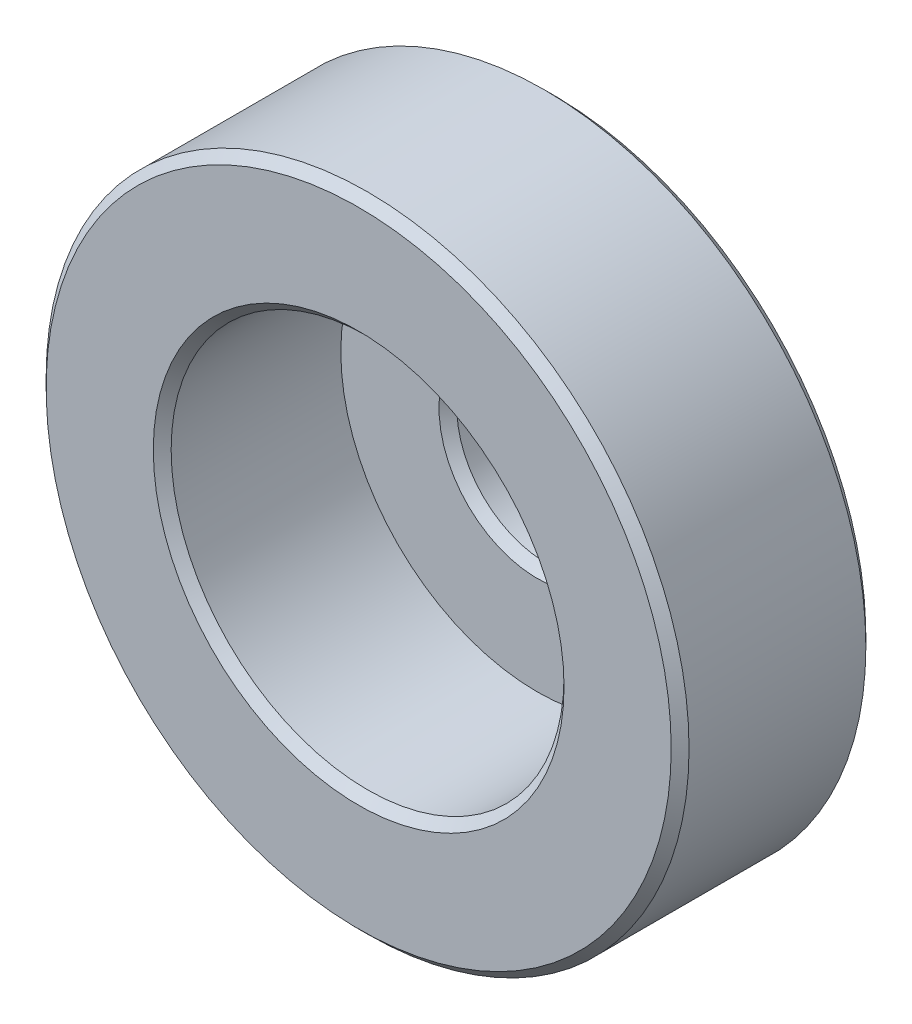
ISO-10303-21;
HEADER;
FILE_DESCRIPTION(('STEP AP214'),'2;1');
FILE_NAME('part.step','',(''),(''),'','','');
FILE_SCHEMA(('AUTOMOTIVE_DESIGN { 1 0 10303 214 1 1 1 1 }'));
ENDSEC;
DATA;
#1=APPLICATION_CONTEXT('core data for automotive mechanical design processes');
#2=APPLICATION_PROTOCOL_DEFINITION('international standard','automotive_design',2000,#1);
#3=PRODUCT_CONTEXT('',#1,'mechanical');
#4=PRODUCT('Part','Part','',(#3));
#5=PRODUCT_RELATED_PRODUCT_CATEGORY('part','',(#4));
#6=PRODUCT_DEFINITION_FORMATION('','',#4);
#7=PRODUCT_DEFINITION_CONTEXT('part definition',#1,'design');
#8=PRODUCT_DEFINITION('design','',#6,#7);
#9=PRODUCT_DEFINITION_SHAPE('','',#8);
#10=(LENGTH_UNIT() NAMED_UNIT(*) SI_UNIT(.MILLI.,.METRE.));
#11=(NAMED_UNIT(*) PLANE_ANGLE_UNIT() SI_UNIT($,.RADIAN.));
#12=(NAMED_UNIT(*) SI_UNIT($,.STERADIAN.) SOLID_ANGLE_UNIT());
#13=UNCERTAINTY_MEASURE_WITH_UNIT(LENGTH_MEASURE(1.E-05),#10,'distance_accuracy_value','');
#14=(GEOMETRIC_REPRESENTATION_CONTEXT(3) GLOBAL_UNCERTAINTY_ASSIGNED_CONTEXT((#13)) GLOBAL_UNIT_ASSIGNED_CONTEXT((#10,
#11,#12)) REPRESENTATION_CONTEXT('',''));
#15=CARTESIAN_POINT('',(0.,0.,0.));
#16=DIRECTION('',(0.,0.,1.));
#17=DIRECTION('',(1.,0.,0.));
#18=AXIS2_PLACEMENT_3D('',#15,#16,#17);
#19=CARTESIAN_POINT('',(-11.,0.,0.));
#20=DIRECTION('',(0.,0.,-1.));
#21=DIRECTION('',(-1.,0.,0.));
#22=AXIS2_PLACEMENT_3D('',#19,#20,#21);
#23=PLANE('',#22);
#24=DIRECTION('',(0.,1.,0.));
#25=VECTOR('',#24,1.);
#26=CARTESIAN_POINT('',(-1.25,-4.84122918275927,0.));
#27=LINE('',#26,#25);
#28=CARTESIAN_POINT('',(-1.25,-10.4253297309965,0.));
#29=VERTEX_POINT('',#28);
#30=CARTESIAN_POINT('',(-1.25,-4.84122918275927,0.));
#31=VERTEX_POINT('',#30);
#32=EDGE_CURVE('E133',#29,#31,#27,.T.);
#33=ORIENTED_EDGE('',*,*,#32,.F.);
#34=CARTESIAN_POINT('',(0.,0.,0.));
#35=DIRECTION('',(0.,0.,-1.));
#36=DIRECTION('',(-1.,0.,0.));
#37=AXIS2_PLACEMENT_3D('',#34,#35,#36);
#38=CIRCLE('',#37,10.5);
#39=CARTESIAN_POINT('',(-1.25,10.4253297309965,0.));
#40=VERTEX_POINT('',#39);
#41=EDGE_CURVE('E209',#29,#40,#38,.T.);
#42=ORIENTED_EDGE('',*,*,#41,.T.);
#43=DIRECTION('',(0.,1.,0.));
#44=VECTOR('',#43,1.);
#45=CARTESIAN_POINT('',(-1.25,10.9409689664164,0.));
#46=LINE('',#45,#44);
#47=CARTESIAN_POINT('',(-1.25,4.84122918275927,0.));
#48=VERTEX_POINT('',#47);
#49=EDGE_CURVE('E142',#48,#40,#46,.T.);
#50=ORIENTED_EDGE('',*,*,#49,.F.);
#51=CARTESIAN_POINT('',(0.,0.,0.));
#52=DIRECTION('',(0.,0.,-1.));
#53=DIRECTION('',(-1.,0.,0.));
#54=AXIS2_PLACEMENT_3D('',#51,#52,#53);
#55=CIRCLE('',#54,5.);
#56=EDGE_CURVE('E167',#31,#48,#55,.T.);
#57=ORIENTED_EDGE('',*,*,#56,.F.);
#58=EDGE_LOOP('',(#33,#42,#50,#57));
#59=FACE_BOUND('',#58,.T.);
#60=ADVANCED_FACE('F33',(#59),#23,.T.);
#61=CARTESIAN_POINT('',(-18.,0.,15.4));
#62=DIRECTION('',(0.,0.,1.));
#63=DIRECTION('',(1.,0.,0.));
#64=AXIS2_PLACEMENT_3D('',#61,#62,#63);
#65=PLANE('',#64);
#66=CARTESIAN_POINT('',(0.,0.,15.4));
#67=DIRECTION('',(0.,0.,1.));
#68=DIRECTION('',(1.,0.,0.));
#69=AXIS2_PLACEMENT_3D('',#66,#67,#68);
#70=CIRCLE('',#69,11.5);
#71=CARTESIAN_POINT('',(11.5,0.,15.4));
#72=VERTEX_POINT('',#71);
#73=EDGE_CURVE('E194',#72,#72,#70,.F.);
#74=ORIENTED_EDGE('',*,*,#73,.T.);
#75=EDGE_LOOP('',(#74));
#76=FACE_BOUND('',#75,.T.);
#77=CARTESIAN_POINT('',(0.,0.,15.4));
#78=DIRECTION('',(0.,0.,1.));
#79=DIRECTION('',(1.,0.,0.));
#80=AXIS2_PLACEMENT_3D('',#77,#78,#79);
#81=CIRCLE('',#80,17.5);
#82=CARTESIAN_POINT('',(17.5,0.,15.4));
#83=VERTEX_POINT('',#82);
#84=EDGE_CURVE('E191',#83,#83,#81,.T.);
#85=ORIENTED_EDGE('',*,*,#84,.T.);
#86=EDGE_LOOP('',(#85));
#87=FACE_BOUND('',#86,.T.);
#88=ADVANCED_FACE('F258',(#76,#87),#65,.T.);
#89=CARTESIAN_POINT('',(0.,0.,0.));
#90=DIRECTION('',(0.,0.,-1.));
#91=DIRECTION('',(-1.,0.,0.));
#92=AXIS2_PLACEMENT_3D('',#89,#90,#91);
#93=CYLINDRICAL_SURFACE('',#92,11.);
#94=CARTESIAN_POINT('',(0.,0.,14.9));
#95=DIRECTION('',(0.,0.,1.));
#96=DIRECTION('',(1.,0.,0.));
#97=AXIS2_PLACEMENT_3D('',#94,#95,#96);
#98=CIRCLE('',#97,11.);
#99=CARTESIAN_POINT('',(11.,0.,14.9));
#100=VERTEX_POINT('',#99);
#101=EDGE_CURVE('E197',#100,#100,#98,.T.);
#102=ORIENTED_EDGE('',*,*,#101,.T.);
#103=EDGE_LOOP('',(#102));
#104=FACE_BOUND('',#103,.T.);
#105=CARTESIAN_POINT('',(0.,0.,5.4));
#106=DIRECTION('',(0.,0.,-1.));
#107=DIRECTION('',(-1.,0.,0.));
#108=AXIS2_PLACEMENT_3D('',#105,#106,#107);
#109=CIRCLE('',#108,11.);
#110=CARTESIAN_POINT('',(-11.,0.,5.4));
#111=VERTEX_POINT('',#110);
#112=EDGE_CURVE('E169',#111,#111,#109,.T.);
#113=ORIENTED_EDGE('',*,*,#112,.T.);
#114=EDGE_LOOP('',(#113));
#115=FACE_BOUND('',#114,.T.);
#116=ADVANCED_FACE('F254',(#104,#115),#93,.F.);
#117=CARTESIAN_POINT('',(-11.,0.,5.4));
#118=DIRECTION('',(0.,0.,1.));
#119=DIRECTION('',(1.,0.,0.));
#120=AXIS2_PLACEMENT_3D('',#117,#118,#119);
#121=PLANE('',#120);
#122=CARTESIAN_POINT('',(0.,0.,5.4));
#123=DIRECTION('',(0.,0.,1.));
#124=DIRECTION('',(1.,0.,0.));
#125=AXIS2_PLACEMENT_3D('',#122,#123,#124);
#126=CIRCLE('',#125,5.49999999999998);
#127=CARTESIAN_POINT('',(5.49999999999999,0.,5.4));
#128=VERTEX_POINT('',#127);
#129=EDGE_CURVE('E185',#128,#128,#126,.F.);
#130=ORIENTED_EDGE('',*,*,#129,.T.);
#131=EDGE_LOOP('',(#130));
#132=FACE_BOUND('',#131,.T.);
#133=ORIENTED_EDGE('',*,*,#112,.F.);
#134=EDGE_LOOP('',(#133));
#135=FACE_BOUND('',#134,.T.);
#136=ADVANCED_FACE('F250',(#132,#135),#121,.T.);
#137=CARTESIAN_POINT('',(0.,0.,0.));
#138=DIRECTION('',(0.,0.,-1.));
#139=DIRECTION('',(-1.,0.,0.));
#140=AXIS2_PLACEMENT_3D('',#137,#138,#139);
#141=CYLINDRICAL_SURFACE('',#140,5.);
#142=CARTESIAN_POINT('',(0.,0.,4.90000000000001));
#143=DIRECTION('',(0.,0.,1.));
#144=DIRECTION('',(1.,0.,0.));
#145=AXIS2_PLACEMENT_3D('',#142,#143,#144);
#146=CIRCLE('',#145,5.);
#147=CARTESIAN_POINT('',(5.,0.,4.90000000000001));
#148=VERTEX_POINT('',#147);
#149=EDGE_CURVE('E188',#148,#148,#146,.T.);
#150=ORIENTED_EDGE('',*,*,#149,.T.);
#151=EDGE_LOOP('',(#150));
#152=FACE_BOUND('',#151,.T.);
#153=DIRECTION('',(0.,0.,-1.));
#154=VECTOR('',#153,1.);
#155=CARTESIAN_POINT('',(-1.25,-4.84122918275927,1.5));
#156=LINE('',#155,#154);
#157=CARTESIAN_POINT('',(-1.25,-4.84122918275927,1.5));
#158=VERTEX_POINT('',#157);
#159=EDGE_CURVE('E140',#158,#31,#156,.T.);
#160=ORIENTED_EDGE('',*,*,#159,.T.);
#161=ORIENTED_EDGE('',*,*,#56,.T.);
#162=DIRECTION('',(0.,0.,-1.));
#163=VECTOR('',#162,1.);
#164=CARTESIAN_POINT('',(-1.25,4.84122918275927,1.5));
#165=LINE('',#164,#163);
#166=CARTESIAN_POINT('',(-1.25,4.84122918275927,1.5));
#167=VERTEX_POINT('',#166);
#168=EDGE_CURVE('E156',#167,#48,#165,.T.);
#169=ORIENTED_EDGE('',*,*,#168,.F.);
#170=CARTESIAN_POINT('',(0.,0.,1.5));
#171=DIRECTION('',(0.,0.,1.));
#172=DIRECTION('',(-1.,0.,0.));
#173=AXIS2_PLACEMENT_3D('',#170,#171,#172);
#174=CIRCLE('',#173,5.);
#175=CARTESIAN_POINT('',(1.25,4.84122918275927,1.5));
#176=VERTEX_POINT('',#175);
#177=EDGE_CURVE('E147',#176,#167,#174,.T.);
#178=ORIENTED_EDGE('',*,*,#177,.F.);
#179=DIRECTION('',(0.,0.,-1.));
#180=VECTOR('',#179,1.);
#181=CARTESIAN_POINT('',(1.25,4.84122918275927,1.5));
#182=LINE('',#181,#180);
#183=CARTESIAN_POINT('',(1.25,4.84122918275927,0.));
#184=VERTEX_POINT('',#183);
#185=EDGE_CURVE('E160',#176,#184,#182,.T.);
#186=ORIENTED_EDGE('',*,*,#185,.T.);
#187=CARTESIAN_POINT('',(1.25,-4.84122918275927,0.));
#188=VERTEX_POINT('',#187);
#189=EDGE_CURVE('E139',#184,#188,#55,.T.);
#190=ORIENTED_EDGE('',*,*,#189,.T.);
#191=DIRECTION('',(0.,0.,-1.));
#192=VECTOR('',#191,1.);
#193=CARTESIAN_POINT('',(1.25,-4.84122918275927,1.5));
#194=LINE('',#193,#192);
#195=CARTESIAN_POINT('',(1.25,-4.84122918275927,1.5));
#196=VERTEX_POINT('',#195);
#197=EDGE_CURVE('E118',#196,#188,#194,.T.);
#198=ORIENTED_EDGE('',*,*,#197,.F.);
#199=CARTESIAN_POINT('',(0.,0.,1.5));
#200=DIRECTION('',(0.,0.,1.));
#201=DIRECTION('',(-1.,0.,0.));
#202=AXIS2_PLACEMENT_3D('',#199,#200,#201);
#203=CIRCLE('',#202,5.);
#204=EDGE_CURVE('E125',#158,#196,#203,.T.);
#205=ORIENTED_EDGE('',*,*,#204,.F.);
#206=EDGE_LOOP('',(#160,#161,#169,#178,#186,#190,#198,#205));
#207=FACE_BOUND('',#206,.T.);
#208=ADVANCED_FACE('F136',(#152,#207),#141,.F.);
#209=DIRECTION('',(0.,-1.,0.));
#210=VECTOR('',#209,1.);
#211=CARTESIAN_POINT('',(1.25,10.9409689664164,0.));
#212=LINE('',#211,#210);
#213=CARTESIAN_POINT('',(1.25,10.4253297309965,0.));
#214=VERTEX_POINT('',#213);
#215=EDGE_CURVE('E151',#214,#184,#212,.T.);
#216=ORIENTED_EDGE('',*,*,#215,.F.);
#217=CARTESIAN_POINT('',(0.,0.,0.));
#218=DIRECTION('',(0.,0.,-1.));
#219=DIRECTION('',(-1.,0.,0.));
#220=AXIS2_PLACEMENT_3D('',#217,#218,#219);
#221=CIRCLE('',#220,10.5);
#222=CARTESIAN_POINT('',(1.25,-10.4253297309965,0.));
#223=VERTEX_POINT('',#222);
#224=EDGE_CURVE('E307',#214,#223,#221,.T.);
#225=ORIENTED_EDGE('',*,*,#224,.T.);
#226=DIRECTION('',(0.,-1.,0.));
#227=VECTOR('',#226,1.);
#228=CARTESIAN_POINT('',(1.25,-4.84122918275927,0.));
#229=LINE('',#228,#227);
#230=EDGE_CURVE('E292',#188,#223,#229,.T.);
#231=ORIENTED_EDGE('',*,*,#230,.F.);
#232=ORIENTED_EDGE('',*,*,#189,.F.);
#233=EDGE_LOOP('',(#216,#225,#231,#232));
#234=FACE_BOUND('',#233,.T.);
#235=ADVANCED_FACE('F243',(#234),#23,.T.);
#236=CARTESIAN_POINT('',(0.,0.,0.));
#237=DIRECTION('',(0.,0.,-1.));
#238=DIRECTION('',(-1.,0.,0.));
#239=AXIS2_PLACEMENT_3D('',#236,#237,#238);
#240=CYLINDRICAL_SURFACE('',#239,11.);
#241=DIRECTION('',(0.,0.,-1.));
#242=VECTOR('',#241,1.);
#243=CARTESIAN_POINT('',(-1.25,10.9287464971972,0.));
#244=LINE('',#243,#242);
#245=CARTESIAN_POINT('',(-1.25,10.9287464971972,0.499999999999997));
#246=VERTEX_POINT('',#245);
#247=CARTESIAN_POINT('',(-1.25,10.9287464971972,1.5));
#248=VERTEX_POINT('',#247);
#249=EDGE_CURVE('E175',#246,#248,#244,.F.);
#250=ORIENTED_EDGE('',*,*,#249,.F.);
#251=CARTESIAN_POINT('',(0.,0.,0.499999999999997));
#252=DIRECTION('',(0.,0.,-1.));
#253=DIRECTION('',(-1.,0.,0.));
#254=AXIS2_PLACEMENT_3D('',#251,#252,#253);
#255=CIRCLE('',#254,11.);
#256=CARTESIAN_POINT('',(-1.25,-10.9287464971972,0.499999999999997));
#257=VERTEX_POINT('',#256);
#258=EDGE_CURVE('E296',#246,#257,#255,.F.);
#259=ORIENTED_EDGE('',*,*,#258,.T.);
#260=DIRECTION('',(0.,0.,-1.));
#261=VECTOR('',#260,1.);
#262=CARTESIAN_POINT('',(-1.25,-10.9287464971972,0.));
#263=LINE('',#262,#261);
#264=CARTESIAN_POINT('',(-1.25,-10.9287464971972,1.5));
#265=VERTEX_POINT('',#264);
#266=EDGE_CURVE('E182',#265,#257,#263,.T.);
#267=ORIENTED_EDGE('',*,*,#266,.F.);
#268=CARTESIAN_POINT('',(0.,0.,1.5));
#269=DIRECTION('',(0.,0.,-1.));
#270=DIRECTION('',(-1.,0.,0.));
#271=AXIS2_PLACEMENT_3D('',#268,#269,#270);
#272=CIRCLE('',#271,11.);
#273=CARTESIAN_POINT('',(1.25,-10.9287464971972,1.5));
#274=VERTEX_POINT('',#273);
#275=EDGE_CURVE('E179',#265,#274,#272,.F.);
#276=ORIENTED_EDGE('',*,*,#275,.T.);
#277=DIRECTION('',(0.,0.,-1.));
#278=VECTOR('',#277,1.);
#279=CARTESIAN_POINT('',(1.25,-10.9287464971972,0.));
#280=LINE('',#279,#278);
#281=CARTESIAN_POINT('',(1.25,-10.9287464971972,0.5));
#282=VERTEX_POINT('',#281);
#283=EDGE_CURVE('E121',#282,#274,#280,.F.);
#284=ORIENTED_EDGE('',*,*,#283,.F.);
#285=CARTESIAN_POINT('',(0.,0.,0.500000000000001));
#286=DIRECTION('',(0.,0.,-1.));
#287=DIRECTION('',(-1.,0.,0.));
#288=AXIS2_PLACEMENT_3D('',#285,#286,#287);
#289=CIRCLE('',#288,11.);
#290=CARTESIAN_POINT('',(1.25,10.9287464971972,0.5));
#291=VERTEX_POINT('',#290);
#292=EDGE_CURVE('E218',#282,#291,#289,.F.);
#293=ORIENTED_EDGE('',*,*,#292,.T.);
#294=DIRECTION('',(0.,0.,-1.));
#295=VECTOR('',#294,1.);
#296=CARTESIAN_POINT('',(1.25,10.9287464971972,0.));
#297=LINE('',#296,#295);
#298=CARTESIAN_POINT('',(1.25,10.9287464971972,1.5));
#299=VERTEX_POINT('',#298);
#300=EDGE_CURVE('E177',#299,#291,#297,.T.);
#301=ORIENTED_EDGE('',*,*,#300,.F.);
#302=CARTESIAN_POINT('',(0.,0.,1.5));
#303=DIRECTION('',(0.,0.,-1.));
#304=DIRECTION('',(-1.,0.,0.));
#305=AXIS2_PLACEMENT_3D('',#302,#303,#304);
#306=CIRCLE('',#305,11.);
#307=EDGE_CURVE('E172',#299,#248,#306,.F.);
#308=ORIENTED_EDGE('',*,*,#307,.T.);
#309=EDGE_LOOP('',(#250,#259,#267,#276,#284,#293,#301,#308));
#310=FACE_BOUND('',#309,.T.);
#311=CARTESIAN_POINT('',(0.,0.,4.5));
#312=DIRECTION('',(0.,0.,-1.));
#313=DIRECTION('',(-1.,0.,0.));
#314=AXIS2_PLACEMENT_3D('',#311,#312,#313);
#315=CIRCLE('',#314,11.);
#316=CARTESIAN_POINT('',(-11.,0.,4.5));
#317=VERTEX_POINT('',#316);
#318=EDGE_CURVE('E162',#317,#317,#315,.T.);
#319=ORIENTED_EDGE('',*,*,#318,.T.);
#320=EDGE_LOOP('',(#319));
#321=FACE_BOUND('',#320,.T.);
#322=ADVANCED_FACE('F239',(#310,#321),#240,.T.);
#323=CARTESIAN_POINT('',(-18.,0.,4.5));
#324=DIRECTION('',(0.,0.,-1.));
#325=DIRECTION('',(-1.,0.,0.));
#326=AXIS2_PLACEMENT_3D('',#323,#324,#325);
#327=PLANE('',#326);
#328=CARTESIAN_POINT('',(0.,0.,4.5));
#329=DIRECTION('',(0.,0.,-1.));
#330=DIRECTION('',(-1.,0.,0.));
#331=AXIS2_PLACEMENT_3D('',#328,#329,#330);
#332=CIRCLE('',#331,17.5);
#333=CARTESIAN_POINT('',(-17.5,0.,4.5));
#334=VERTEX_POINT('',#333);
#335=EDGE_CURVE('E206',#334,#334,#332,.T.);
#336=ORIENTED_EDGE('',*,*,#335,.T.);
#337=EDGE_LOOP('',(#336));
#338=FACE_BOUND('',#337,.T.);
#339=ORIENTED_EDGE('',*,*,#318,.F.);
#340=EDGE_LOOP('',(#339));
#341=FACE_BOUND('',#340,.T.);
#342=ADVANCED_FACE('F235',(#338,#341),#327,.T.);
#343=CARTESIAN_POINT('',(0.,0.,0.));
#344=DIRECTION('',(0.,0.,-1.));
#345=DIRECTION('',(-1.,0.,0.));
#346=AXIS2_PLACEMENT_3D('',#343,#344,#345);
#347=CYLINDRICAL_SURFACE('',#346,18.);
#348=CARTESIAN_POINT('',(0.,0.,14.9));
#349=DIRECTION('',(0.,0.,1.));
#350=DIRECTION('',(1.,0.,0.));
#351=AXIS2_PLACEMENT_3D('',#348,#349,#350);
#352=CIRCLE('',#351,18.);
#353=CARTESIAN_POINT('',(18.,0.,14.9));
#354=VERTEX_POINT('',#353);
#355=EDGE_CURVE('E203',#354,#354,#352,.F.);
#356=ORIENTED_EDGE('',*,*,#355,.T.);
#357=EDGE_LOOP('',(#356));
#358=FACE_BOUND('',#357,.T.);
#359=CARTESIAN_POINT('',(0.,0.,4.99999999999999));
#360=DIRECTION('',(0.,0.,-1.));
#361=DIRECTION('',(-1.,0.,0.));
#362=AXIS2_PLACEMENT_3D('',#359,#360,#361);
#363=CIRCLE('',#362,18.);
#364=CARTESIAN_POINT('',(-18.,0.,4.99999999999999));
#365=VERTEX_POINT('',#364);
#366=EDGE_CURVE('E200',#365,#365,#363,.F.);
#367=ORIENTED_EDGE('',*,*,#366,.T.);
#368=EDGE_LOOP('',(#367));
#369=FACE_BOUND('',#368,.T.);
#370=ADVANCED_FACE('F232',(#358,#369),#347,.T.);
#371=CARTESIAN_POINT('',(1.25,10.9409689664164,1.5));
#372=DIRECTION('',(1.,0.,0.));
#373=DIRECTION('',(0.,0.,-1.));
#374=AXIS2_PLACEMENT_3D('',#371,#372,#373);
#375=PLANE('',#374);
#376=ORIENTED_EDGE('',*,*,#300,.T.);
#377=CARTESIAN_POINT('',(1.25,10.9287464971972,0.5));
#378=CARTESIAN_POINT('',(1.25,10.8448569910639,0.416653287652448));
#379=CARTESIAN_POINT('',(1.25,10.76096084082,0.333313264818164));
#380=CARTESIAN_POINT('',(1.25,10.5931552520865,0.166646598151493));
#381=CARTESIAN_POINT('',(1.25,10.5092458135968,0.0833199543191108));
#382=CARTESIAN_POINT('',(1.25,10.4253297309965,0.));
#383=B_SPLINE_CURVE_WITH_KNOTS('',3,(#377,#378,#379,#380,#381,#382),.UNSPECIFIED.,.F.,.F.,(4,2,
4),(0.,0.354763457652868,0.709526915410628),.UNSPECIFIED.);
#384=EDGE_CURVE('E11',#291,#214,#383,.T.);
#385=ORIENTED_EDGE('',*,*,#384,.T.);
#386=ORIENTED_EDGE('',*,*,#215,.T.);
#387=ORIENTED_EDGE('',*,*,#185,.F.);
#388=DIRECTION('',(0.,-1.,0.));
#389=VECTOR('',#388,1.);
#390=CARTESIAN_POINT('',(1.25,10.9409689664164,1.5));
#391=LINE('',#390,#389);
#392=EDGE_CURVE('E154',#299,#176,#391,.T.);
#393=ORIENTED_EDGE('',*,*,#392,.F.);
#394=EDGE_LOOP('',(#376,#385,#386,#387,#393));
#395=FACE_BOUND('',#394,.T.);
#396=ADVANCED_FACE('F228',(#395),#375,.F.);
#397=CARTESIAN_POINT('',(-1.25,10.9409689664164,1.5));
#398=DIRECTION('',(-1.,0.,0.));
#399=DIRECTION('',(0.,0.,1.));
#400=AXIS2_PLACEMENT_3D('',#397,#398,#399);
#401=PLANE('',#400);
#402=ORIENTED_EDGE('',*,*,#49,.T.);
#403=CARTESIAN_POINT('',(-1.25,10.4253297309965,0.));
#404=CARTESIAN_POINT('',(-1.25,10.5092458135968,0.0833199543191108));
#405=CARTESIAN_POINT('',(-1.25,10.5931552520865,0.166646598151493));
#406=CARTESIAN_POINT('',(-1.25,10.76096084082,0.333313264818163));
#407=CARTESIAN_POINT('',(-1.25,10.8448569910639,0.416653287652446));
#408=CARTESIAN_POINT('',(-1.25,10.9287464971972,0.499999999999997));
#409=B_SPLINE_CURVE_WITH_KNOTS('',3,(#403,#404,#405,#406,#407,#408),.UNSPECIFIED.,.F.,.F.,(4,2,
4),(0.,0.354763457757757,0.709526915410622),.UNSPECIFIED.);
#410=EDGE_CURVE('E212',#40,#246,#409,.T.);
#411=ORIENTED_EDGE('',*,*,#410,.T.);
#412=ORIENTED_EDGE('',*,*,#249,.T.);
#413=DIRECTION('',(0.,1.,0.));
#414=VECTOR('',#413,1.);
#415=CARTESIAN_POINT('',(-1.25,10.9409689664164,1.5));
#416=LINE('',#415,#414);
#417=EDGE_CURVE('E150',#167,#248,#416,.T.);
#418=ORIENTED_EDGE('',*,*,#417,.F.);
#419=ORIENTED_EDGE('',*,*,#168,.T.);
#420=EDGE_LOOP('',(#402,#411,#412,#418,#419));
#421=FACE_BOUND('',#420,.T.);
#422=ADVANCED_FACE('F223',(#421),#401,.F.);
#423=CARTESIAN_POINT('',(0.,0.,1.5));
#424=DIRECTION('',(0.,0.,-1.));
#425=DIRECTION('',(-1.,0.,0.));
#426=AXIS2_PLACEMENT_3D('',#423,#424,#425);
#427=PLANE('',#426);
#428=ORIENTED_EDGE('',*,*,#392,.T.);
#429=ORIENTED_EDGE('',*,*,#177,.T.);
#430=ORIENTED_EDGE('',*,*,#417,.T.);
#431=ORIENTED_EDGE('',*,*,#307,.F.);
#432=EDGE_LOOP('',(#428,#429,#430,#431));
#433=FACE_BOUND('',#432,.T.);
#434=ADVANCED_FACE('F227',(#433),#427,.T.);
#435=CARTESIAN_POINT('',(-1.25,-4.84122918275927,1.5));
#436=DIRECTION('',(-1.,0.,0.));
#437=DIRECTION('',(0.,0.,1.));
#438=AXIS2_PLACEMENT_3D('',#435,#436,#437);
#439=PLANE('',#438);
#440=ORIENTED_EDGE('',*,*,#266,.T.);
#441=CARTESIAN_POINT('',(-1.25,-10.9287464971972,0.499999999999997));
#442=CARTESIAN_POINT('',(-1.25,-10.8448569910639,0.416653287652446));
#443=CARTESIAN_POINT('',(-1.25,-10.76096084082,0.333313264818162));
#444=CARTESIAN_POINT('',(-1.25,-10.5931552520865,0.166646598151493));
#445=CARTESIAN_POINT('',(-1.25,-10.5092458135968,0.0833199543191116));
#446=CARTESIAN_POINT('',(-1.25,-10.4253297309965,0.));
#447=B_SPLINE_CURVE_WITH_KNOTS('',3,(#441,#442,#443,#444,#445,#446),.UNSPECIFIED.,.F.,.F.,(4,2,
4),(0.,0.354763457652867,0.709526915410622),.UNSPECIFIED.);
#448=EDGE_CURVE('E295',#257,#29,#447,.T.);
#449=ORIENTED_EDGE('',*,*,#448,.T.);
#450=ORIENTED_EDGE('',*,*,#32,.T.);
#451=ORIENTED_EDGE('',*,*,#159,.F.);
#452=DIRECTION('',(0.,1.,0.));
#453=VECTOR('',#452,1.);
#454=CARTESIAN_POINT('',(-1.25,-4.84122918275927,1.5));
#455=LINE('',#454,#453);
#456=EDGE_CURVE('E124',#265,#158,#455,.T.);
#457=ORIENTED_EDGE('',*,*,#456,.F.);
#458=EDGE_LOOP('',(#440,#449,#450,#451,#457));
#459=FACE_BOUND('',#458,.T.);
#460=ADVANCED_FACE('F306',(#459),#439,.F.);
#461=CARTESIAN_POINT('',(1.25,-4.84122918275927,1.5));
#462=DIRECTION('',(1.,0.,0.));
#463=DIRECTION('',(0.,0.,-1.));
#464=AXIS2_PLACEMENT_3D('',#461,#462,#463);
#465=PLANE('',#464);
#466=ORIENTED_EDGE('',*,*,#230,.T.);
#467=CARTESIAN_POINT('',(1.25,-10.4253297309965,0.));
#468=CARTESIAN_POINT('',(1.25,-10.5092458135968,0.0833199543191107));
#469=CARTESIAN_POINT('',(1.25,-10.5931552520865,0.166646598151493));
#470=CARTESIAN_POINT('',(1.25,-10.76096084082,0.333313264818164));
#471=CARTESIAN_POINT('',(1.25,-10.8448569910639,0.416653287652448));
#472=CARTESIAN_POINT('',(1.25,-10.9287464971972,0.5));
#473=B_SPLINE_CURVE_WITH_KNOTS('',3,(#467,#468,#469,#470,#471,#472),.UNSPECIFIED.,.F.,.F.,(4,2,
4),(0.,0.35476345775776,0.709526915410629),.UNSPECIFIED.);
#474=EDGE_CURVE('E46',#223,#282,#473,.T.);
#475=ORIENTED_EDGE('',*,*,#474,.T.);
#476=ORIENTED_EDGE('',*,*,#283,.T.);
#477=DIRECTION('',(0.,-1.,0.));
#478=VECTOR('',#477,1.);
#479=CARTESIAN_POINT('',(1.25,-4.84122918275927,1.5));
#480=LINE('',#479,#478);
#481=EDGE_CURVE('E113',#196,#274,#480,.T.);
#482=ORIENTED_EDGE('',*,*,#481,.F.);
#483=ORIENTED_EDGE('',*,*,#197,.T.);
#484=EDGE_LOOP('',(#466,#475,#476,#482,#483));
#485=FACE_BOUND('',#484,.T.);
#486=ADVANCED_FACE('F116',(#485),#465,.F.);
#487=CARTESIAN_POINT('',(0.,0.,1.5));
#488=DIRECTION('',(0.,0.,-1.));
#489=DIRECTION('',(-1.,0.,0.));
#490=AXIS2_PLACEMENT_3D('',#487,#488,#489);
#491=PLANE('',#490);
#492=ORIENTED_EDGE('',*,*,#456,.T.);
#493=ORIENTED_EDGE('',*,*,#204,.T.);
#494=ORIENTED_EDGE('',*,*,#481,.T.);
#495=ORIENTED_EDGE('',*,*,#275,.F.);
#496=EDGE_LOOP('',(#492,#493,#494,#495));
#497=FACE_BOUND('',#496,.T.);
#498=ADVANCED_FACE('F128',(#497),#491,.T.);
#499=CARTESIAN_POINT('',(0.,0.,5.4));
#500=DIRECTION('',(0.,0.,1.));
#501=DIRECTION('',(1.,0.,0.));
#502=AXIS2_PLACEMENT_3D('',#499,#500,#501);
#503=CONICAL_SURFACE('',#502,5.49999999999998,0.785398163397444);
#504=ORIENTED_EDGE('',*,*,#149,.F.);
#505=EDGE_LOOP('',(#504));
#506=FACE_BOUND('',#505,.T.);
#507=ORIENTED_EDGE('',*,*,#129,.F.);
#508=EDGE_LOOP('',(#507));
#509=FACE_BOUND('',#508,.T.);
#510=ADVANCED_FACE('F263',(#506,#509),#503,.F.);
#511=CARTESIAN_POINT('',(0.,0.,15.4));
#512=DIRECTION('',(0.,0.,1.));
#513=DIRECTION('',(1.,0.,0.));
#514=AXIS2_PLACEMENT_3D('',#511,#512,#513);
#515=CONICAL_SURFACE('',#514,11.5,0.785398163397445);
#516=ORIENTED_EDGE('',*,*,#101,.F.);
#517=EDGE_LOOP('',(#516));
#518=FACE_BOUND('',#517,.T.);
#519=ORIENTED_EDGE('',*,*,#73,.F.);
#520=EDGE_LOOP('',(#519));
#521=FACE_BOUND('',#520,.T.);
#522=ADVANCED_FACE('F266',(#518,#521),#515,.F.);
#523=CARTESIAN_POINT('',(0.,0.,14.9));
#524=DIRECTION('',(0.,0.,-1.));
#525=DIRECTION('',(-1.,0.,0.));
#526=AXIS2_PLACEMENT_3D('',#523,#524,#525);
#527=CONICAL_SURFACE('',#526,18.,0.785398163397452);
#528=ORIENTED_EDGE('',*,*,#84,.F.);
#529=EDGE_LOOP('',(#528));
#530=FACE_BOUND('',#529,.T.);
#531=ORIENTED_EDGE('',*,*,#355,.F.);
#532=EDGE_LOOP('',(#531));
#533=FACE_BOUND('',#532,.T.);
#534=ADVANCED_FACE('F270',(#530,#533),#527,.T.);
#535=CARTESIAN_POINT('',(0.,0.,4.5));
#536=DIRECTION('',(0.,0.,1.));
#537=DIRECTION('',(1.,0.,0.));
#538=AXIS2_PLACEMENT_3D('',#535,#536,#537);
#539=CONICAL_SURFACE('',#538,17.5,0.785398163397452);
#540=ORIENTED_EDGE('',*,*,#366,.F.);
#541=EDGE_LOOP('',(#540));
#542=FACE_BOUND('',#541,.T.);
#543=ORIENTED_EDGE('',*,*,#335,.F.);
#544=EDGE_LOOP('',(#543));
#545=FACE_BOUND('',#544,.T.);
#546=ADVANCED_FACE('F273',(#542,#545),#539,.T.);
#547=CARTESIAN_POINT('',(0.,0.,0.));
#548=DIRECTION('',(0.,0.,1.));
#549=DIRECTION('',(1.,0.,0.));
#550=AXIS2_PLACEMENT_3D('',#547,#548,#549);
#551=CONICAL_SURFACE('',#550,10.5,0.785398163397447);
#552=ORIENTED_EDGE('',*,*,#448,.F.);
#553=ORIENTED_EDGE('',*,*,#258,.F.);
#554=ORIENTED_EDGE('',*,*,#410,.F.);
#555=ORIENTED_EDGE('',*,*,#41,.F.);
#556=EDGE_LOOP('',(#552,#553,#554,#555));
#557=FACE_BOUND('',#556,.T.);
#558=ADVANCED_FACE('F220',(#557),#551,.T.);
#559=CARTESIAN_POINT('',(0.,0.,0.));
#560=DIRECTION('',(0.,0.,1.));
#561=DIRECTION('',(1.,0.,0.));
#562=AXIS2_PLACEMENT_3D('',#559,#560,#561);
#563=CONICAL_SURFACE('',#562,10.5,0.785398163397446);
#564=ORIENTED_EDGE('',*,*,#384,.F.);
#565=ORIENTED_EDGE('',*,*,#292,.F.);
#566=ORIENTED_EDGE('',*,*,#474,.F.);
#567=ORIENTED_EDGE('',*,*,#224,.F.);
#568=EDGE_LOOP('',(#564,#565,#566,#567));
#569=FACE_BOUND('',#568,.T.);
#570=ADVANCED_FACE('F35',(#569),#563,.T.);
#571=CLOSED_SHELL('',(#60,#88,#116,#136,#208,#235,#322,#342,#370,#396,#422,#434,#460,#486,#498,
#510,#522,#534,#546,#558,#570));
#572=MANIFOLD_SOLID_BREP('B2',#571);
#573=ADVANCED_BREP_SHAPE_REPRESENTATION('',(#18,#572),#14);
#574=SHAPE_DEFINITION_REPRESENTATION(#9,#573);
ENDSEC;
END-ISO-10303-21;
